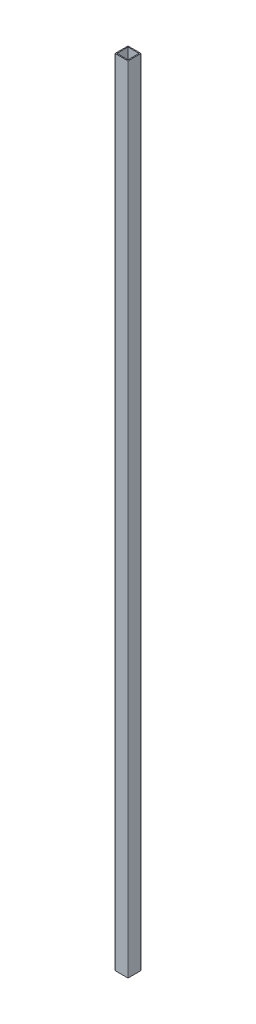
ISO-10303-21;
HEADER;
FILE_DESCRIPTION(('STEP AP214'),'2;1');
FILE_NAME('part.step','',(''),(''),'','','');
FILE_SCHEMA(('AUTOMOTIVE_DESIGN { 1 0 10303 214 1 1 1 1 }'));
ENDSEC;
DATA;
#1=APPLICATION_CONTEXT('core data for automotive mechanical design processes');
#2=APPLICATION_PROTOCOL_DEFINITION('international standard','automotive_design',2000,#1);
#3=PRODUCT_CONTEXT('',#1,'mechanical');
#4=PRODUCT('Part','Part','',(#3));
#5=PRODUCT_RELATED_PRODUCT_CATEGORY('part','',(#4));
#6=PRODUCT_DEFINITION_FORMATION('','',#4);
#7=PRODUCT_DEFINITION_CONTEXT('part definition',#1,'design');
#8=PRODUCT_DEFINITION('design','',#6,#7);
#9=PRODUCT_DEFINITION_SHAPE('','',#8);
#10=(LENGTH_UNIT() NAMED_UNIT(*) SI_UNIT(.MILLI.,.METRE.));
#11=(NAMED_UNIT(*) PLANE_ANGLE_UNIT() SI_UNIT($,.RADIAN.));
#12=(NAMED_UNIT(*) SI_UNIT($,.STERADIAN.) SOLID_ANGLE_UNIT());
#13=UNCERTAINTY_MEASURE_WITH_UNIT(LENGTH_MEASURE(1.E-05),#10,'distance_accuracy_value','');
#14=(GEOMETRIC_REPRESENTATION_CONTEXT(3) GLOBAL_UNCERTAINTY_ASSIGNED_CONTEXT((#13)) GLOBAL_UNIT_ASSIGNED_CONTEXT((#10,
#11,#12)) REPRESENTATION_CONTEXT('',''));
#15=CARTESIAN_POINT('',(0.,0.,0.));
#16=DIRECTION('',(0.,0.,1.));
#17=DIRECTION('',(1.,0.,0.));
#18=AXIS2_PLACEMENT_3D('',#15,#16,#17);
#19=CARTESIAN_POINT('',(19.5,1220.,-0.5));
#20=DIRECTION('',(0.,1.,0.));
#21=DIRECTION('',(0.,0.,1.));
#22=AXIS2_PLACEMENT_3D('',#19,#20,#21);
#23=PLANE('',#22);
#24=CARTESIAN_POINT('',(19.5,1220.,-0.5));
#25=DIRECTION('',(0.,1.,0.));
#26=DIRECTION('',(0.,0.,1.));
#27=AXIS2_PLACEMENT_3D('',#24,#25,#26);
#28=CIRCLE('',#27,0.5);
#29=CARTESIAN_POINT('',(19.5,1220.,0.));
#30=VERTEX_POINT('',#29);
#31=CARTESIAN_POINT('',(20.,1220.,-0.5));
#32=VERTEX_POINT('',#31);
#33=EDGE_CURVE('E177',#30,#32,#28,.T.);
#34=ORIENTED_EDGE('',*,*,#33,.T.);
#35=DIRECTION('',(0.,0.,-1.));
#36=VECTOR('',#35,1.);
#37=CARTESIAN_POINT('',(20.,1220.,-0.5));
#38=LINE('',#37,#36);
#39=CARTESIAN_POINT('',(20.,1220.,-19.5));
#40=VERTEX_POINT('',#39);
#41=EDGE_CURVE('E181',#32,#40,#38,.T.);
#42=ORIENTED_EDGE('',*,*,#41,.T.);
#43=CARTESIAN_POINT('',(19.5,1220.,-19.5));
#44=DIRECTION('',(0.,1.,0.));
#45=DIRECTION('',(0.,0.,-1.));
#46=AXIS2_PLACEMENT_3D('',#43,#44,#45);
#47=CIRCLE('',#46,0.5);
#48=CARTESIAN_POINT('',(19.5,1220.,-20.));
#49=VERTEX_POINT('',#48);
#50=EDGE_CURVE('E185',#40,#49,#47,.T.);
#51=ORIENTED_EDGE('',*,*,#50,.T.);
#52=DIRECTION('',(-1.,0.,0.));
#53=VECTOR('',#52,1.);
#54=CARTESIAN_POINT('',(0.5,1220.,-20.));
#55=LINE('',#54,#53);
#56=CARTESIAN_POINT('',(0.5,1220.,-20.));
#57=VERTEX_POINT('',#56);
#58=EDGE_CURVE('E188',#49,#57,#55,.T.);
#59=ORIENTED_EDGE('',*,*,#58,.T.);
#60=CARTESIAN_POINT('',(0.5,1220.,-19.5));
#61=DIRECTION('',(0.,1.,0.));
#62=DIRECTION('',(0.,0.,-1.));
#63=AXIS2_PLACEMENT_3D('',#60,#61,#62);
#64=CIRCLE('',#63,0.5);
#65=CARTESIAN_POINT('',(0.,1220.,-19.5));
#66=VERTEX_POINT('',#65);
#67=EDGE_CURVE('E191',#57,#66,#64,.T.);
#68=ORIENTED_EDGE('',*,*,#67,.T.);
#69=DIRECTION('',(0.,0.,1.));
#70=VECTOR('',#69,1.);
#71=CARTESIAN_POINT('',(0.,1220.,-0.500000000000004));
#72=LINE('',#71,#70);
#73=CARTESIAN_POINT('',(0.,1220.,-0.500000000000003));
#74=VERTEX_POINT('',#73);
#75=EDGE_CURVE('E194',#66,#74,#72,.T.);
#76=ORIENTED_EDGE('',*,*,#75,.T.);
#77=CARTESIAN_POINT('',(0.5,1220.,-0.5));
#78=DIRECTION('',(0.,1.,0.));
#79=DIRECTION('',(0.,0.,-1.));
#80=AXIS2_PLACEMENT_3D('',#77,#78,#79);
#81=CIRCLE('',#80,0.5);
#82=CARTESIAN_POINT('',(0.500000000000004,1220.,0.));
#83=VERTEX_POINT('',#82);
#84=EDGE_CURVE('E197',#74,#83,#81,.T.);
#85=ORIENTED_EDGE('',*,*,#84,.T.);
#86=DIRECTION('',(1.,0.,0.));
#87=VECTOR('',#86,1.);
#88=CARTESIAN_POINT('',(0.500000000000004,1220.,0.));
#89=LINE('',#88,#87);
#90=EDGE_CURVE('E200',#83,#30,#89,.T.);
#91=ORIENTED_EDGE('',*,*,#90,.T.);
#92=EDGE_LOOP('',(#34,#42,#51,#59,#68,#76,#85,#91));
#93=FACE_BOUND('',#92,.T.);
#94=DIRECTION('',(1.,0.,0.));
#95=VECTOR('',#94,1.);
#96=CARTESIAN_POINT('',(1.5,1220.,-1.5));
#97=LINE('',#96,#95);
#98=CARTESIAN_POINT('',(1.5,1220.,-1.5));
#99=VERTEX_POINT('',#98);
#100=CARTESIAN_POINT('',(18.5,1220.,-1.5));
#101=VERTEX_POINT('',#100);
#102=EDGE_CURVE('E138',#99,#101,#97,.T.);
#103=ORIENTED_EDGE('',*,*,#102,.F.);
#104=DIRECTION('',(0.,0.,1.));
#105=VECTOR('',#104,1.);
#106=CARTESIAN_POINT('',(1.5,1220.,-1.5));
#107=LINE('',#106,#105);
#108=CARTESIAN_POINT('',(1.5,1220.,-18.5));
#109=VERTEX_POINT('',#108);
#110=EDGE_CURVE('E129',#109,#99,#107,.T.);
#111=ORIENTED_EDGE('',*,*,#110,.F.);
#112=DIRECTION('',(-1.,0.,0.));
#113=VECTOR('',#112,1.);
#114=CARTESIAN_POINT('',(1.5,1220.,-18.5));
#115=LINE('',#114,#113);
#116=CARTESIAN_POINT('',(18.5,1220.,-18.5));
#117=VERTEX_POINT('',#116);
#118=EDGE_CURVE('E155',#117,#109,#115,.T.);
#119=ORIENTED_EDGE('',*,*,#118,.F.);
#120=DIRECTION('',(0.,0.,-1.));
#121=VECTOR('',#120,1.);
#122=CARTESIAN_POINT('',(18.5,1220.,-1.5));
#123=LINE('',#122,#121);
#124=EDGE_CURVE('E151',#101,#117,#123,.T.);
#125=ORIENTED_EDGE('',*,*,#124,.F.);
#126=EDGE_LOOP('',(#103,#111,#119,#125));
#127=FACE_BOUND('',#126,.T.);
#128=ADVANCED_FACE('F39',(#93,#127),#23,.T.);
#129=CARTESIAN_POINT('',(19.5,0.,-0.5));
#130=DIRECTION('',(0.,1.,0.));
#131=DIRECTION('',(0.,0.,1.));
#132=AXIS2_PLACEMENT_3D('',#129,#130,#131);
#133=PLANE('',#132);
#134=CARTESIAN_POINT('',(19.5,0.,-0.5));
#135=DIRECTION('',(0.,1.,0.));
#136=DIRECTION('',(0.,0.,1.));
#137=AXIS2_PLACEMENT_3D('',#134,#135,#136);
#138=CIRCLE('',#137,0.5);
#139=CARTESIAN_POINT('',(19.5,0.,0.));
#140=VERTEX_POINT('',#139);
#141=CARTESIAN_POINT('',(20.,0.,-0.5));
#142=VERTEX_POINT('',#141);
#143=EDGE_CURVE('E147',#140,#142,#138,.T.);
#144=ORIENTED_EDGE('',*,*,#143,.F.);
#145=DIRECTION('',(1.,0.,0.));
#146=VECTOR('',#145,1.);
#147=CARTESIAN_POINT('',(0.500000000000004,0.,0.));
#148=LINE('',#147,#146);
#149=CARTESIAN_POINT('',(0.500000000000004,0.,0.));
#150=VERTEX_POINT('',#149);
#151=EDGE_CURVE('E182',#150,#140,#148,.T.);
#152=ORIENTED_EDGE('',*,*,#151,.F.);
#153=CARTESIAN_POINT('',(0.5,0.,-0.5));
#154=DIRECTION('',(0.,1.,0.));
#155=DIRECTION('',(0.,0.,-1.));
#156=AXIS2_PLACEMENT_3D('',#153,#154,#155);
#157=CIRCLE('',#156,0.5);
#158=CARTESIAN_POINT('',(0.,0.,-0.500000000000003));
#159=VERTEX_POINT('',#158);
#160=EDGE_CURVE('E222',#159,#150,#157,.T.);
#161=ORIENTED_EDGE('',*,*,#160,.F.);
#162=DIRECTION('',(0.,0.,1.));
#163=VECTOR('',#162,1.);
#164=CARTESIAN_POINT('',(0.,0.,-0.500000000000004));
#165=LINE('',#164,#163);
#166=CARTESIAN_POINT('',(0.,0.,-19.5));
#167=VERTEX_POINT('',#166);
#168=EDGE_CURVE('E219',#167,#159,#165,.T.);
#169=ORIENTED_EDGE('',*,*,#168,.F.);
#170=CARTESIAN_POINT('',(0.5,0.,-19.5));
#171=DIRECTION('',(0.,1.,0.));
#172=DIRECTION('',(0.,0.,-1.));
#173=AXIS2_PLACEMENT_3D('',#170,#171,#172);
#174=CIRCLE('',#173,0.5);
#175=CARTESIAN_POINT('',(0.5,0.,-20.));
#176=VERTEX_POINT('',#175);
#177=EDGE_CURVE('E216',#176,#167,#174,.T.);
#178=ORIENTED_EDGE('',*,*,#177,.F.);
#179=DIRECTION('',(-1.,0.,0.));
#180=VECTOR('',#179,1.);
#181=CARTESIAN_POINT('',(0.5,0.,-20.));
#182=LINE('',#181,#180);
#183=CARTESIAN_POINT('',(19.5,0.,-20.));
#184=VERTEX_POINT('',#183);
#185=EDGE_CURVE('E213',#184,#176,#182,.T.);
#186=ORIENTED_EDGE('',*,*,#185,.F.);
#187=CARTESIAN_POINT('',(19.5,0.,-19.5));
#188=DIRECTION('',(0.,1.,0.));
#189=DIRECTION('',(0.,0.,-1.));
#190=AXIS2_PLACEMENT_3D('',#187,#188,#189);
#191=CIRCLE('',#190,0.5);
#192=CARTESIAN_POINT('',(20.,0.,-19.5));
#193=VERTEX_POINT('',#192);
#194=EDGE_CURVE('E210',#193,#184,#191,.T.);
#195=ORIENTED_EDGE('',*,*,#194,.F.);
#196=DIRECTION('',(0.,0.,-1.));
#197=VECTOR('',#196,1.);
#198=CARTESIAN_POINT('',(20.,0.,-0.5));
#199=LINE('',#198,#197);
#200=EDGE_CURVE('E207',#142,#193,#199,.T.);
#201=ORIENTED_EDGE('',*,*,#200,.F.);
#202=EDGE_LOOP('',(#144,#152,#161,#169,#178,#186,#195,#201));
#203=FACE_BOUND('',#202,.T.);
#204=DIRECTION('',(0.,0.,1.));
#205=VECTOR('',#204,1.);
#206=CARTESIAN_POINT('',(1.5,0.,-1.5));
#207=LINE('',#206,#205);
#208=CARTESIAN_POINT('',(1.5,0.,-18.5));
#209=VERTEX_POINT('',#208);
#210=CARTESIAN_POINT('',(1.5,0.,-1.5));
#211=VERTEX_POINT('',#210);
#212=EDGE_CURVE('E63',#209,#211,#207,.T.);
#213=ORIENTED_EDGE('',*,*,#212,.T.);
#214=DIRECTION('',(1.,0.,0.));
#215=VECTOR('',#214,1.);
#216=CARTESIAN_POINT('',(1.5,0.,-1.5));
#217=LINE('',#216,#215);
#218=CARTESIAN_POINT('',(18.5,0.,-1.5));
#219=VERTEX_POINT('',#218);
#220=EDGE_CURVE('E145',#211,#219,#217,.T.);
#221=ORIENTED_EDGE('',*,*,#220,.T.);
#222=DIRECTION('',(0.,0.,-1.));
#223=VECTOR('',#222,1.);
#224=CARTESIAN_POINT('',(18.5,0.,-1.5));
#225=LINE('',#224,#223);
#226=CARTESIAN_POINT('',(18.5,0.,-18.5));
#227=VERTEX_POINT('',#226);
#228=EDGE_CURVE('E164',#219,#227,#225,.T.);
#229=ORIENTED_EDGE('',*,*,#228,.T.);
#230=DIRECTION('',(-1.,0.,0.));
#231=VECTOR('',#230,1.);
#232=CARTESIAN_POINT('',(1.5,0.,-18.5));
#233=LINE('',#232,#231);
#234=EDGE_CURVE('E139',#227,#209,#233,.T.);
#235=ORIENTED_EDGE('',*,*,#234,.T.);
#236=EDGE_LOOP('',(#213,#221,#229,#235));
#237=FACE_BOUND('',#236,.T.);
#238=ADVANCED_FACE('F261',(#203,#237),#133,.F.);
#239=CARTESIAN_POINT('',(19.5,1220.,-0.5));
#240=DIRECTION('',(0.,-1.,0.));
#241=DIRECTION('',(0.,0.,-1.));
#242=AXIS2_PLACEMENT_3D('',#239,#240,#241);
#243=CYLINDRICAL_SURFACE('',#242,0.5);
#244=ORIENTED_EDGE('',*,*,#143,.T.);
#245=DIRECTION('',(0.,-1.,0.));
#246=VECTOR('',#245,1.);
#247=CARTESIAN_POINT('',(20.,1220.,-0.5));
#248=LINE('',#247,#246);
#249=EDGE_CURVE('E11',#32,#142,#248,.T.);
#250=ORIENTED_EDGE('',*,*,#249,.F.);
#251=ORIENTED_EDGE('',*,*,#33,.F.);
#252=DIRECTION('',(0.,-1.,0.));
#253=VECTOR('',#252,1.);
#254=CARTESIAN_POINT('',(19.5,1220.,0.));
#255=LINE('',#254,#253);
#256=EDGE_CURVE('E203',#30,#140,#255,.T.);
#257=ORIENTED_EDGE('',*,*,#256,.T.);
#258=EDGE_LOOP('',(#244,#250,#251,#257));
#259=FACE_BOUND('',#258,.T.);
#260=ADVANCED_FACE('F41',(#259),#243,.T.);
#261=CARTESIAN_POINT('',(20.,1220.,-0.5));
#262=DIRECTION('',(-1.,0.,0.));
#263=DIRECTION('',(0.,0.,1.));
#264=AXIS2_PLACEMENT_3D('',#261,#262,#263);
#265=PLANE('',#264);
#266=ORIENTED_EDGE('',*,*,#200,.T.);
#267=DIRECTION('',(0.,-1.,0.));
#268=VECTOR('',#267,1.);
#269=CARTESIAN_POINT('',(20.,1220.,-19.5));
#270=LINE('',#269,#268);
#271=EDGE_CURVE('E48',#40,#193,#270,.T.);
#272=ORIENTED_EDGE('',*,*,#271,.F.);
#273=ORIENTED_EDGE('',*,*,#41,.F.);
#274=ORIENTED_EDGE('',*,*,#249,.T.);
#275=EDGE_LOOP('',(#266,#272,#273,#274));
#276=FACE_BOUND('',#275,.T.);
#277=ADVANCED_FACE('F278',(#276),#265,.F.);
#278=CARTESIAN_POINT('',(19.5,1220.,-19.5));
#279=DIRECTION('',(0.,-1.,0.));
#280=DIRECTION('',(0.,0.,-1.));
#281=AXIS2_PLACEMENT_3D('',#278,#279,#280);
#282=CYLINDRICAL_SURFACE('',#281,0.5);
#283=ORIENTED_EDGE('',*,*,#194,.T.);
#284=DIRECTION('',(0.,-1.,0.));
#285=VECTOR('',#284,1.);
#286=CARTESIAN_POINT('',(19.5,1220.,-20.));
#287=LINE('',#286,#285);
#288=EDGE_CURVE('E246',#49,#184,#287,.T.);
#289=ORIENTED_EDGE('',*,*,#288,.F.);
#290=ORIENTED_EDGE('',*,*,#50,.F.);
#291=ORIENTED_EDGE('',*,*,#271,.T.);
#292=EDGE_LOOP('',(#283,#289,#290,#291));
#293=FACE_BOUND('',#292,.T.);
#294=ADVANCED_FACE('F255',(#293),#282,.T.);
#295=CARTESIAN_POINT('',(0.5,1220.,-20.));
#296=DIRECTION('',(0.,0.,1.));
#297=DIRECTION('',(1.,0.,0.));
#298=AXIS2_PLACEMENT_3D('',#295,#296,#297);
#299=PLANE('',#298);
#300=ORIENTED_EDGE('',*,*,#185,.T.);
#301=DIRECTION('',(0.,-1.,0.));
#302=VECTOR('',#301,1.);
#303=CARTESIAN_POINT('',(0.5,1220.,-20.));
#304=LINE('',#303,#302);
#305=EDGE_CURVE('E242',#57,#176,#304,.T.);
#306=ORIENTED_EDGE('',*,*,#305,.F.);
#307=ORIENTED_EDGE('',*,*,#58,.F.);
#308=ORIENTED_EDGE('',*,*,#288,.T.);
#309=EDGE_LOOP('',(#300,#306,#307,#308));
#310=FACE_BOUND('',#309,.T.);
#311=ADVANCED_FACE('F267',(#310),#299,.F.);
#312=CARTESIAN_POINT('',(0.5,1220.,-19.5));
#313=DIRECTION('',(0.,-1.,0.));
#314=DIRECTION('',(0.,0.,-1.));
#315=AXIS2_PLACEMENT_3D('',#312,#313,#314);
#316=CYLINDRICAL_SURFACE('',#315,0.5);
#317=ORIENTED_EDGE('',*,*,#177,.T.);
#318=DIRECTION('',(0.,-1.,0.));
#319=VECTOR('',#318,1.);
#320=CARTESIAN_POINT('',(0.,1220.,-19.5));
#321=LINE('',#320,#319);
#322=EDGE_CURVE('E238',#66,#167,#321,.T.);
#323=ORIENTED_EDGE('',*,*,#322,.F.);
#324=ORIENTED_EDGE('',*,*,#67,.F.);
#325=ORIENTED_EDGE('',*,*,#305,.T.);
#326=EDGE_LOOP('',(#317,#323,#324,#325));
#327=FACE_BOUND('',#326,.T.);
#328=ADVANCED_FACE('F271',(#327),#316,.T.);
#329=CARTESIAN_POINT('',(0.,1220.,-0.500000000000004));
#330=DIRECTION('',(1.,0.,0.));
#331=DIRECTION('',(0.,0.,-1.));
#332=AXIS2_PLACEMENT_3D('',#329,#330,#331);
#333=PLANE('',#332);
#334=ORIENTED_EDGE('',*,*,#168,.T.);
#335=DIRECTION('',(0.,-1.,0.));
#336=VECTOR('',#335,1.);
#337=CARTESIAN_POINT('',(0.,1220.,-0.500000000000003));
#338=LINE('',#337,#336);
#339=EDGE_CURVE('E234',#74,#159,#338,.T.);
#340=ORIENTED_EDGE('',*,*,#339,.F.);
#341=ORIENTED_EDGE('',*,*,#75,.F.);
#342=ORIENTED_EDGE('',*,*,#322,.T.);
#343=EDGE_LOOP('',(#334,#340,#341,#342));
#344=FACE_BOUND('',#343,.T.);
#345=ADVANCED_FACE('F291',(#344),#333,.F.);
#346=CARTESIAN_POINT('',(0.5,1220.,-0.5));
#347=DIRECTION('',(0.,-1.,0.));
#348=DIRECTION('',(0.,0.,-1.));
#349=AXIS2_PLACEMENT_3D('',#346,#347,#348);
#350=CYLINDRICAL_SURFACE('',#349,0.5);
#351=ORIENTED_EDGE('',*,*,#160,.T.);
#352=DIRECTION('',(0.,-1.,0.));
#353=VECTOR('',#352,1.);
#354=CARTESIAN_POINT('',(0.500000000000004,1220.,0.));
#355=LINE('',#354,#353);
#356=EDGE_CURVE('E230',#83,#150,#355,.T.);
#357=ORIENTED_EDGE('',*,*,#356,.F.);
#358=ORIENTED_EDGE('',*,*,#84,.F.);
#359=ORIENTED_EDGE('',*,*,#339,.T.);
#360=EDGE_LOOP('',(#351,#357,#358,#359));
#361=FACE_BOUND('',#360,.T.);
#362=ADVANCED_FACE('F289',(#361),#350,.T.);
#363=CARTESIAN_POINT('',(0.500000000000004,1220.,0.));
#364=DIRECTION('',(0.,0.,-1.));
#365=DIRECTION('',(-1.,0.,0.));
#366=AXIS2_PLACEMENT_3D('',#363,#364,#365);
#367=PLANE('',#366);
#368=ORIENTED_EDGE('',*,*,#151,.T.);
#369=ORIENTED_EDGE('',*,*,#256,.F.);
#370=ORIENTED_EDGE('',*,*,#90,.F.);
#371=ORIENTED_EDGE('',*,*,#356,.T.);
#372=EDGE_LOOP('',(#368,#369,#370,#371));
#373=FACE_BOUND('',#372,.T.);
#374=ADVANCED_FACE('F284',(#373),#367,.F.);
#375=CARTESIAN_POINT('',(1.5,1220.,-1.5));
#376=DIRECTION('',(1.,0.,0.));
#377=DIRECTION('',(0.,0.,-1.));
#378=AXIS2_PLACEMENT_3D('',#375,#376,#377);
#379=PLANE('',#378);
#380=ORIENTED_EDGE('',*,*,#212,.F.);
#381=DIRECTION('',(0.,-1.,0.));
#382=VECTOR('',#381,1.);
#383=CARTESIAN_POINT('',(1.5,1220.,-18.5));
#384=LINE('',#383,#382);
#385=EDGE_CURVE('E133',#109,#209,#384,.T.);
#386=ORIENTED_EDGE('',*,*,#385,.F.);
#387=ORIENTED_EDGE('',*,*,#110,.T.);
#388=DIRECTION('',(0.,-1.,0.));
#389=VECTOR('',#388,1.);
#390=CARTESIAN_POINT('',(1.5,1220.,-1.5));
#391=LINE('',#390,#389);
#392=EDGE_CURVE('E132',#99,#211,#391,.T.);
#393=ORIENTED_EDGE('',*,*,#392,.T.);
#394=EDGE_LOOP('',(#380,#386,#387,#393));
#395=FACE_BOUND('',#394,.T.);
#396=ADVANCED_FACE('F131',(#395),#379,.T.);
#397=CARTESIAN_POINT('',(1.5,1220.,-1.5));
#398=DIRECTION('',(0.,0.,-1.));
#399=DIRECTION('',(-1.,0.,0.));
#400=AXIS2_PLACEMENT_3D('',#397,#398,#399);
#401=PLANE('',#400);
#402=ORIENTED_EDGE('',*,*,#220,.F.);
#403=ORIENTED_EDGE('',*,*,#392,.F.);
#404=ORIENTED_EDGE('',*,*,#102,.T.);
#405=DIRECTION('',(0.,-1.,0.));
#406=VECTOR('',#405,1.);
#407=CARTESIAN_POINT('',(18.5,1220.,-1.5));
#408=LINE('',#407,#406);
#409=EDGE_CURVE('E148',#101,#219,#408,.T.);
#410=ORIENTED_EDGE('',*,*,#409,.T.);
#411=EDGE_LOOP('',(#402,#403,#404,#410));
#412=FACE_BOUND('',#411,.T.);
#413=ADVANCED_FACE('F142',(#412),#401,.T.);
#414=CARTESIAN_POINT('',(18.5,1220.,-1.5));
#415=DIRECTION('',(-1.,0.,0.));
#416=DIRECTION('',(0.,0.,1.));
#417=AXIS2_PLACEMENT_3D('',#414,#415,#416);
#418=PLANE('',#417);
#419=ORIENTED_EDGE('',*,*,#228,.F.);
#420=ORIENTED_EDGE('',*,*,#409,.F.);
#421=ORIENTED_EDGE('',*,*,#124,.T.);
#422=DIRECTION('',(0.,-1.,0.));
#423=VECTOR('',#422,1.);
#424=CARTESIAN_POINT('',(18.5,1220.,-18.5));
#425=LINE('',#424,#423);
#426=EDGE_CURVE('E55',#117,#227,#425,.T.);
#427=ORIENTED_EDGE('',*,*,#426,.T.);
#428=EDGE_LOOP('',(#419,#420,#421,#427));
#429=FACE_BOUND('',#428,.T.);
#430=ADVANCED_FACE('F316',(#429),#418,.T.);
#431=CARTESIAN_POINT('',(1.5,1220.,-18.5));
#432=DIRECTION('',(0.,0.,1.));
#433=DIRECTION('',(1.,0.,0.));
#434=AXIS2_PLACEMENT_3D('',#431,#432,#433);
#435=PLANE('',#434);
#436=ORIENTED_EDGE('',*,*,#234,.F.);
#437=ORIENTED_EDGE('',*,*,#426,.F.);
#438=ORIENTED_EDGE('',*,*,#118,.T.);
#439=ORIENTED_EDGE('',*,*,#385,.T.);
#440=EDGE_LOOP('',(#436,#437,#438,#439));
#441=FACE_BOUND('',#440,.T.);
#442=ADVANCED_FACE('F320',(#441),#435,.T.);
#443=CLOSED_SHELL('',(#128,#238,#260,#277,#294,#311,#328,#345,#362,#374,#396,#413,#430,#442));
#444=MANIFOLD_SOLID_BREP('B2',#443);
#445=ADVANCED_BREP_SHAPE_REPRESENTATION('',(#18,#444),#14);
#446=SHAPE_DEFINITION_REPRESENTATION(#9,#445);
ENDSEC;
END-ISO-10303-21;
